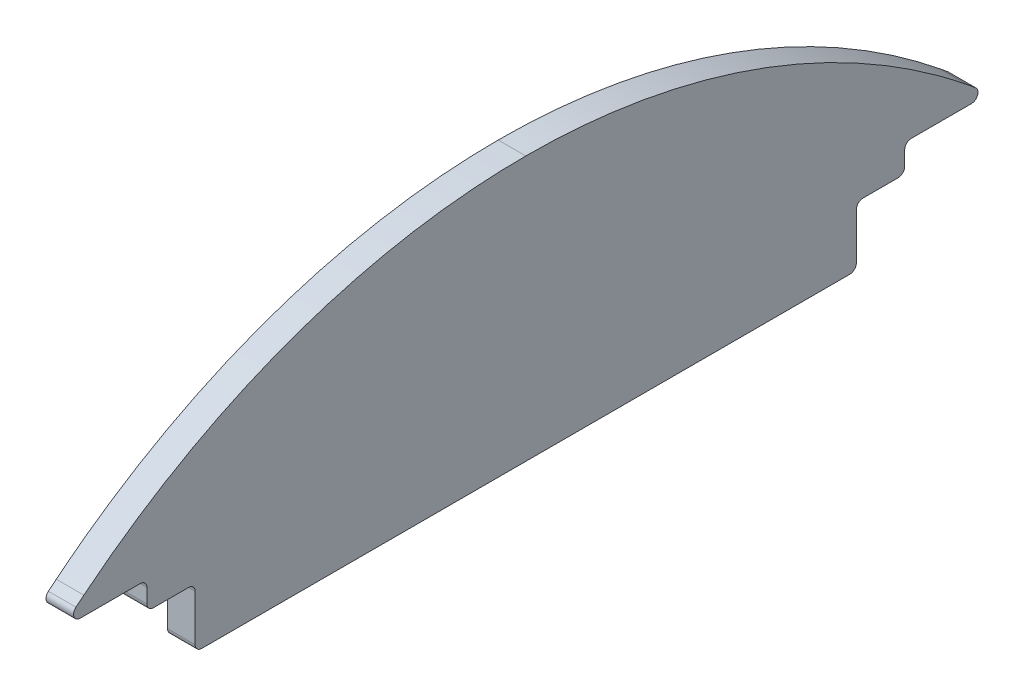
ISO-10303-21;
HEADER;
FILE_DESCRIPTION(('STEP AP214'),'2;1');
FILE_NAME('part.step','',(''),(''),'','','');
FILE_SCHEMA(('AUTOMOTIVE_DESIGN { 1 0 10303 214 1 1 1 1 }'));
ENDSEC;
DATA;
#1=APPLICATION_CONTEXT('core data for automotive mechanical design processes');
#2=APPLICATION_PROTOCOL_DEFINITION('international standard','automotive_design',2000,#1);
#3=PRODUCT_CONTEXT('',#1,'mechanical');
#4=PRODUCT('Part','Part','',(#3));
#5=PRODUCT_RELATED_PRODUCT_CATEGORY('part','',(#4));
#6=PRODUCT_DEFINITION_FORMATION('','',#4);
#7=PRODUCT_DEFINITION_CONTEXT('part definition',#1,'design');
#8=PRODUCT_DEFINITION('design','',#6,#7);
#9=PRODUCT_DEFINITION_SHAPE('','',#8);
#10=(LENGTH_UNIT() NAMED_UNIT(*) SI_UNIT(.MILLI.,.METRE.));
#11=(NAMED_UNIT(*) PLANE_ANGLE_UNIT() SI_UNIT($,.RADIAN.));
#12=(NAMED_UNIT(*) SI_UNIT($,.STERADIAN.) SOLID_ANGLE_UNIT());
#13=UNCERTAINTY_MEASURE_WITH_UNIT(LENGTH_MEASURE(1.E-05),#10,'distance_accuracy_value','');
#14=(GEOMETRIC_REPRESENTATION_CONTEXT(3) GLOBAL_UNCERTAINTY_ASSIGNED_CONTEXT((#13)) GLOBAL_UNIT_ASSIGNED_CONTEXT((#10,
#11,#12)) REPRESENTATION_CONTEXT('',''));
#15=CARTESIAN_POINT('',(0.,0.,0.));
#16=DIRECTION('',(0.,0.,1.));
#17=DIRECTION('',(1.,0.,0.));
#18=AXIS2_PLACEMENT_3D('',#15,#16,#17);
#19=CARTESIAN_POINT('',(-3.175,-11.8182922500257,0.));
#20=DIRECTION('',(0.,-1.,0.));
#21=DIRECTION('',(0.,0.,-1.));
#22=AXIS2_PLACEMENT_3D('',#19,#20,#21);
#23=PLANE('',#22);
#24=DIRECTION('',(0.,0.,-1.));
#25=VECTOR('',#24,1.);
#26=CARTESIAN_POINT('',(-3.175,-11.8182922500257,0.));
#27=LINE('',#26,#25);
#28=CARTESIAN_POINT('',(-3.175,-11.8182922500257,42.9012176847946));
#29=VERTEX_POINT('',#28);
#30=CARTESIAN_POINT('',(-3.175,-11.8182922500257,38.862));
#31=VERTEX_POINT('',#30);
#32=EDGE_CURVE('E268',#29,#31,#27,.T.);
#33=ORIENTED_EDGE('',*,*,#32,.T.);
#34=DIRECTION('',(1.,0.,0.));
#35=VECTOR('',#34,1.);
#36=CARTESIAN_POINT('',(0.,-11.8182922500257,38.862));
#37=LINE('',#36,#35);
#38=CARTESIAN_POINT('',(0.,-11.8182922500257,38.862));
#39=VERTEX_POINT('',#38);
#40=EDGE_CURVE('E419',#31,#39,#37,.T.);
#41=ORIENTED_EDGE('',*,*,#40,.T.);
#42=DIRECTION('',(0.,0.,-1.));
#43=VECTOR('',#42,1.);
#44=CARTESIAN_POINT('',(0.,-11.8182922500257,0.));
#45=LINE('',#44,#43);
#46=CARTESIAN_POINT('',(0.,-11.8182922500257,42.9012176847946));
#47=VERTEX_POINT('',#46);
#48=EDGE_CURVE('E525',#47,#39,#45,.T.);
#49=ORIENTED_EDGE('',*,*,#48,.F.);
#50=DIRECTION('',(1.,0.,0.));
#51=VECTOR('',#50,1.);
#52=CARTESIAN_POINT('',(-3.175,-11.8182922500257,42.9012176847946));
#53=LINE('',#52,#51);
#54=EDGE_CURVE('E417',#47,#29,#53,.F.);
#55=ORIENTED_EDGE('',*,*,#54,.T.);
#56=EDGE_LOOP('',(#33,#41,#49,#55));
#57=FACE_BOUND('',#56,.T.);
#58=ADVANCED_FACE('F38',(#57),#23,.T.);
#59=CARTESIAN_POINT('',(-3.175,11.8182914060908,-1.3436136690915E-06));
#60=CARTESIAN_POINT('',(-3.175,11.8077008078148,0.978048687892894));
#61=CARTESIAN_POINT('',(-3.175,11.786478389756,2.93795558926664));
#62=CARTESIAN_POINT('',(-3.175,11.614460814345,5.87961776837712));
#63=CARTESIAN_POINT('',(-3.175,11.3386627365121,8.82505008649082));
#64=CARTESIAN_POINT('',(-3.175,10.9480993080017,11.7706933833138));
#65=CARTESIAN_POINT('',(-3.175,10.4447203638757,14.7129490050857));
#66=CARTESIAN_POINT('',(-3.175,9.82713785355596,17.6481786841743));
#67=CARTESIAN_POINT('',(-3.175,9.09502004358851,20.5727043298639));
#68=CARTESIAN_POINT('',(-3.175,8.24791206700482,23.4828077640568));
#69=CARTESIAN_POINT('',(-3.175,7.28556085838308,26.3747308041278));
#70=CARTESIAN_POINT('',(-3.175,6.20783285537487,29.2446740978727));
#71=CARTESIAN_POINT('',(-3.175,5.014747428177,32.0888008013733));
#72=CARTESIAN_POINT('',(-3.175,3.70645854412326,34.9032222043669));
#73=CARTESIAN_POINT('',(-3.175,2.28332893837055,37.6840516060898));
#74=CARTESIAN_POINT('',(-3.175,0.745684639946392,40.4272012713032));
#75=CARTESIAN_POINT('',(-3.175,-0.905232129618184,43.1291482128365));
#76=CARTESIAN_POINT('',(-3.175,-2.67082562329719,45.7840472794463));
#77=CARTESIAN_POINT('',(-3.175,-4.54167859246508,48.3946206003429));
#78=CARTESIAN_POINT('',(-3.175,-5.87456843367821,50.07943235586));
#79=CARTESIAN_POINT('',(-3.175,-6.54342277936944,50.9248838174178));
#80=B_SPLINE_CURVE_WITH_KNOTS('',3,(#59,#60,#61,#62,#63,#64,#65,#66,#67,#68,#69,#70,#71,#72,#73,
#74,#75,#76,#77,#78,#79),.UNSPECIFIED.,.F.,.F.,(4,1,1,1,1,1,1,1,1,1,1,1,1,1,1,1,1,1,4),(0.,
0.0531569619047574,0.106520825251357,0.160104404736984,0.21392119364063,0.267985268264316,
0.322311180193934,0.376913837137565,0.431808373255161,0.487010010040896,0.542533908954217,
0.598395017114746,0.654607907476403,0.711186614976743,0.768144470217334,0.825493932271454,
0.883246422238132,0.941412159169929,1.),.UNSPECIFIED.);
#81=DIRECTION('',(1.,0.,0.));
#82=VECTOR('',#81,1.);
#83=SURFACE_OF_LINEAR_EXTRUSION('',#80,#82);
#84=CARTESIAN_POINT('',(0.,-6.54342277936944,50.9248838174178));
#85=CARTESIAN_POINT('',(0.,-5.87456843367821,50.07943235586));
#86=CARTESIAN_POINT('',(0.,-4.54167859246508,48.3946206003429));
#87=CARTESIAN_POINT('',(0.,-2.67082562329719,45.7840472794463));
#88=CARTESIAN_POINT('',(0.,-0.905232129618184,43.1291482128365));
#89=CARTESIAN_POINT('',(0.,0.745684639946392,40.4272012713032));
#90=CARTESIAN_POINT('',(0.,2.28332893837055,37.6840516060898));
#91=CARTESIAN_POINT('',(0.,3.70645854412326,34.9032222043669));
#92=CARTESIAN_POINT('',(0.,5.014747428177,32.0888008013733));
#93=CARTESIAN_POINT('',(0.,6.20783285537487,29.2446740978727));
#94=CARTESIAN_POINT('',(0.,7.28556085838308,26.3747308041278));
#95=CARTESIAN_POINT('',(0.,8.24791206700482,23.4828077640568));
#96=CARTESIAN_POINT('',(0.,9.09502004358851,20.5727043298639));
#97=CARTESIAN_POINT('',(0.,9.82713785355596,17.6481786841743));
#98=CARTESIAN_POINT('',(0.,10.4447203638757,14.7129490050857));
#99=CARTESIAN_POINT('',(0.,10.9480993080017,11.7706933833138));
#100=CARTESIAN_POINT('',(0.,11.3386627365121,8.82505008649082));
#101=CARTESIAN_POINT('',(0.,11.614460814345,5.87961776837712));
#102=CARTESIAN_POINT('',(0.,11.786478389756,2.93795558926664));
#103=CARTESIAN_POINT('',(0.,11.8077008078148,0.978048687892894));
#104=CARTESIAN_POINT('',(0.,11.8182914060908,-1.3436136690915E-06));
#105=B_SPLINE_CURVE_WITH_KNOTS('',3,(#84,#85,#86,#87,#88,#89,#90,#91,#92,#93,#94,#95,#96,#97,
#98,#99,#100,#101,#102,#103,#104),.UNSPECIFIED.,.F.,.F.,(4,1,1,1,1,1,1,1,1,1,1,1,1,1,1,1,1,1,4),
(0.,0.0585878408300714,0.116753577761868,0.174506067728546,0.231855529782666,0.288813385023257,
0.345392092523597,0.401604982885254,0.457466091045783,0.512989989959104,0.568191626744839,
0.623086162862435,0.677688819806066,0.732014731735684,0.78607880635937,0.839895595263016,
0.893479174748643,0.946843038095243,1.),.UNSPECIFIED.);
#106=CARTESIAN_POINT('',(0.,11.8182914060908,-1.3436136804792E-06));
#107=VERTEX_POINT('',#106);
#108=CARTESIAN_POINT('',(0.,-6.54342277936944,50.9248838174178));
#109=VERTEX_POINT('',#108);
#110=EDGE_CURVE('E482',#107,#109,#105,.F.);
#111=ORIENTED_EDGE('',*,*,#110,.F.);
#112=DIRECTION('',(1.,0.,0.));
#113=VECTOR('',#112,1.);
#114=CARTESIAN_POINT('',(-3.175,11.8182914060908,-1.3436136804792E-06));
#115=LINE('',#114,#113);
#116=CARTESIAN_POINT('',(-3.175,11.8182914060908,-1.3436136804792E-06));
#117=VERTEX_POINT('',#116);
#118=EDGE_CURVE('E221',#117,#107,#115,.T.);
#119=ORIENTED_EDGE('',*,*,#118,.F.);
#120=CARTESIAN_POINT('',(-3.175,11.8182914060908,-1.3436136690915E-06));
#121=CARTESIAN_POINT('',(-3.175,11.8077008078148,0.978048687892894));
#122=CARTESIAN_POINT('',(-3.175,11.786478389756,2.93795558926664));
#123=CARTESIAN_POINT('',(-3.175,11.614460814345,5.87961776837712));
#124=CARTESIAN_POINT('',(-3.175,11.3386627365121,8.82505008649082));
#125=CARTESIAN_POINT('',(-3.175,10.9480993080017,11.7706933833138));
#126=CARTESIAN_POINT('',(-3.175,10.4447203638757,14.7129490050857));
#127=CARTESIAN_POINT('',(-3.175,9.82713785355596,17.6481786841743));
#128=CARTESIAN_POINT('',(-3.175,9.09502004358851,20.5727043298639));
#129=CARTESIAN_POINT('',(-3.175,8.24791206700482,23.4828077640568));
#130=CARTESIAN_POINT('',(-3.175,7.28556085838308,26.3747308041278));
#131=CARTESIAN_POINT('',(-3.175,6.20783285537487,29.2446740978727));
#132=CARTESIAN_POINT('',(-3.175,5.014747428177,32.0888008013733));
#133=CARTESIAN_POINT('',(-3.175,3.70645854412326,34.9032222043669));
#134=CARTESIAN_POINT('',(-3.175,2.28332893837055,37.6840516060898));
#135=CARTESIAN_POINT('',(-3.175,0.745684639946392,40.4272012713032));
#136=CARTESIAN_POINT('',(-3.175,-0.905232129618184,43.1291482128365));
#137=CARTESIAN_POINT('',(-3.175,-2.67082562329719,45.7840472794463));
#138=CARTESIAN_POINT('',(-3.175,-4.54167859246508,48.3946206003429));
#139=CARTESIAN_POINT('',(-3.175,-5.87456843367821,50.07943235586));
#140=CARTESIAN_POINT('',(-3.175,-6.54342277936944,50.9248838174178));
#141=B_SPLINE_CURVE_WITH_KNOTS('',3,(#120,#121,#122,#123,#124,#125,#126,#127,#128,#129,#130,
#131,#132,#133,#134,#135,#136,#137,#138,#139,#140),.UNSPECIFIED.,.F.,.F.,(4,1,1,1,1,1,1,1,1,1,1,
1,1,1,1,1,1,1,4),(0.,0.0531569619047574,0.106520825251357,0.160104404736984,0.21392119364063,
0.267985268264316,0.322311180193934,0.376913837137565,0.431808373255161,0.487010010040896,
0.542533908954217,0.598395017114746,0.654607907476403,0.711186614976743,0.768144470217334,
0.825493932271454,0.883246422238132,0.941412159169929,1.),.UNSPECIFIED.);
#142=CARTESIAN_POINT('',(-3.175,-6.54342277936944,50.9248838174178));
#143=VERTEX_POINT('',#142);
#144=EDGE_CURVE('E213',#117,#143,#141,.T.);
#145=ORIENTED_EDGE('',*,*,#144,.T.);
#146=DIRECTION('',(1.,0.,0.));
#147=VECTOR('',#146,1.);
#148=CARTESIAN_POINT('',(-3.175,-6.54342277936944,50.9248838174178));
#149=LINE('',#148,#147);
#150=EDGE_CURVE('E192',#143,#109,#149,.T.);
#151=ORIENTED_EDGE('',*,*,#150,.T.);
#152=EDGE_LOOP('',(#111,#119,#145,#151));
#153=FACE_BOUND('',#152,.T.);
#154=ADVANCED_FACE('F220',(#153),#83,.T.);
#155=CARTESIAN_POINT('',(-3.175,-6.54342673515373,-50.9248893248076));
#156=CARTESIAN_POINT('',(-3.175,-5.90920633073445,-50.124144808466));
#157=CARTESIAN_POINT('',(-3.175,-4.64509800920185,-48.5281258228331));
#158=CARTESIAN_POINT('',(-3.175,-2.86419140149534,-46.0590871280758));
#159=CARTESIAN_POINT('',(-3.175,-1.17764504415261,-43.5498876670016));
#160=CARTESIAN_POINT('',(-3.175,0.406107926055533,-40.9978890230891));
#161=CARTESIAN_POINT('',(-3.175,1.88834277352226,-38.4081550633008));
#162=CARTESIAN_POINT('',(-3.175,3.26794007148094,-35.783665585972));
#163=CARTESIAN_POINT('',(-3.175,4.54459003603489,-33.1279121859897));
#164=CARTESIAN_POINT('',(-3.175,5.71793620145614,-30.444209343123));
#165=CARTESIAN_POINT('',(-3.175,6.78779660829162,-27.7358771668646));
#166=CARTESIAN_POINT('',(-3.175,7.75409969560054,-25.006192871303));
#167=CARTESIAN_POINT('',(-3.175,8.6168943287459,-22.2584037033444));
#168=CARTESIAN_POINT('',(-3.175,9.37634697084789,-19.495723603283));
#169=CARTESIAN_POINT('',(-3.175,10.0327178834013,-16.7213342277638));
#170=CARTESIAN_POINT('',(-3.175,10.586434134795,-13.9383848450785));
#171=CARTESIAN_POINT('',(-3.175,11.0377996797584,-11.149992553993));
#172=CARTESIAN_POINT('',(-3.175,11.3880527711752,-8.3592424235178));
#173=CARTESIAN_POINT('',(-3.175,11.6354276249399,-5.56918767928669));
#174=CARTESIAN_POINT('',(-3.175,11.7897476203975,-2.78284979237358));
#175=CARTESIAN_POINT('',(-3.175,11.8087884552902,-0.926482230833133));
#176=CARTESIAN_POINT('',(-3.175,11.8182914060908,-1.3436136804792E-06));
#177=B_SPLINE_CURVE_WITH_KNOTS('',3,(#155,#156,#157,#158,#159,#160,#161,#162,#163,#164,#165,
#166,#167,#168,#169,#170,#171,#172,#173,#174,#175,#176),.UNSPECIFIED.,.F.,.F.,(4,1,1,1,1,1,1,1,
1,1,1,1,1,1,1,1,1,1,1,4),(0.,0.0555148591435664,0.110650485104373,0.165414313175614,
0.219814889236602,0.273861748069295,0.327565288598301,0.380936647167056,0.433987569965251,
0.486730285719037,0.539177379744368,0.591341670441763,0.643236089277617,0.694873565251109,
0.74626691478746,0.7974287379278,0.848371321604614,0.89910655070147,0.949645827498104,1.),.UNSPECIFIED.);
#178=DIRECTION('',(1.,0.,0.));
#179=VECTOR('',#178,1.);
#180=SURFACE_OF_LINEAR_EXTRUSION('',#177,#179);
#181=CARTESIAN_POINT('',(0.,11.8182914060908,-1.3436136804792E-06));
#182=CARTESIAN_POINT('',(0.,11.8087884552902,-0.926482230833133));
#183=CARTESIAN_POINT('',(0.,11.7897476203975,-2.78284979237358));
#184=CARTESIAN_POINT('',(0.,11.6354276249399,-5.56918767928669));
#185=CARTESIAN_POINT('',(0.,11.3880527711752,-8.3592424235178));
#186=CARTESIAN_POINT('',(0.,11.0377996797584,-11.149992553993));
#187=CARTESIAN_POINT('',(0.,10.586434134795,-13.9383848450785));
#188=CARTESIAN_POINT('',(0.,10.0327178834013,-16.7213342277638));
#189=CARTESIAN_POINT('',(0.,9.37634697084789,-19.495723603283));
#190=CARTESIAN_POINT('',(0.,8.6168943287459,-22.2584037033444));
#191=CARTESIAN_POINT('',(0.,7.75409969560054,-25.006192871303));
#192=CARTESIAN_POINT('',(0.,6.78779660829162,-27.7358771668646));
#193=CARTESIAN_POINT('',(0.,5.71793620145614,-30.444209343123));
#194=CARTESIAN_POINT('',(0.,4.54459003603489,-33.1279121859897));
#195=CARTESIAN_POINT('',(0.,3.26794007148094,-35.783665585972));
#196=CARTESIAN_POINT('',(0.,1.88834277352226,-38.4081550633008));
#197=CARTESIAN_POINT('',(0.,0.406107926055533,-40.9978890230891));
#198=CARTESIAN_POINT('',(0.,-1.17764504415261,-43.5498876670016));
#199=CARTESIAN_POINT('',(0.,-2.86419140149534,-46.0590871280758));
#200=CARTESIAN_POINT('',(0.,-4.64509800920185,-48.5281258228331));
#201=CARTESIAN_POINT('',(0.,-5.90920633073445,-50.124144808466));
#202=CARTESIAN_POINT('',(0.,-6.54342673515373,-50.9248893248076));
#203=B_SPLINE_CURVE_WITH_KNOTS('',3,(#181,#182,#183,#184,#185,#186,#187,#188,#189,#190,#191,
#192,#193,#194,#195,#196,#197,#198,#199,#200,#201,#202),.UNSPECIFIED.,.F.,.F.,(4,1,1,1,1,1,1,1,
1,1,1,1,1,1,1,1,1,1,1,4),(0.,0.0503541725018962,0.100893449298529,0.151628678395386,
0.2025712620722,0.25373308521254,0.305126434748891,0.356763910722383,0.408658329558237,
0.460822620255632,0.513269714280963,0.566012430034749,0.619063352832944,0.672434711401699,
0.726138251930705,0.780185110763397,0.834585686824386,0.889349514895626,0.944485140856433,1.),.UNSPECIFIED.);
#204=CARTESIAN_POINT('',(0.,-6.54342673515373,-50.9248893248076));
#205=VERTEX_POINT('',#204);
#206=EDGE_CURVE('E222',#205,#107,#203,.F.);
#207=ORIENTED_EDGE('',*,*,#206,.F.);
#208=DIRECTION('',(1.,0.,0.));
#209=VECTOR('',#208,1.);
#210=CARTESIAN_POINT('',(-3.175,-6.54342673515373,-50.9248893248076));
#211=LINE('',#210,#209);
#212=CARTESIAN_POINT('',(-3.175,-6.54342673515373,-50.9248893248076));
#213=VERTEX_POINT('',#212);
#214=EDGE_CURVE('E205',#213,#205,#211,.T.);
#215=ORIENTED_EDGE('',*,*,#214,.F.);
#216=CARTESIAN_POINT('',(-3.175,-6.54342673515373,-50.9248893248076));
#217=CARTESIAN_POINT('',(-3.175,-5.90920633073445,-50.124144808466));
#218=CARTESIAN_POINT('',(-3.175,-4.64509800920185,-48.5281258228331));
#219=CARTESIAN_POINT('',(-3.175,-2.86419140149534,-46.0590871280758));
#220=CARTESIAN_POINT('',(-3.175,-1.17764504415261,-43.5498876670016));
#221=CARTESIAN_POINT('',(-3.175,0.406107926055533,-40.9978890230891));
#222=CARTESIAN_POINT('',(-3.175,1.88834277352226,-38.4081550633008));
#223=CARTESIAN_POINT('',(-3.175,3.26794007148094,-35.783665585972));
#224=CARTESIAN_POINT('',(-3.175,4.54459003603489,-33.1279121859897));
#225=CARTESIAN_POINT('',(-3.175,5.71793620145614,-30.444209343123));
#226=CARTESIAN_POINT('',(-3.175,6.78779660829162,-27.7358771668646));
#227=CARTESIAN_POINT('',(-3.175,7.75409969560054,-25.006192871303));
#228=CARTESIAN_POINT('',(-3.175,8.6168943287459,-22.2584037033444));
#229=CARTESIAN_POINT('',(-3.175,9.37634697084789,-19.495723603283));
#230=CARTESIAN_POINT('',(-3.175,10.0327178834013,-16.7213342277638));
#231=CARTESIAN_POINT('',(-3.175,10.586434134795,-13.9383848450785));
#232=CARTESIAN_POINT('',(-3.175,11.0377996797584,-11.149992553993));
#233=CARTESIAN_POINT('',(-3.175,11.3880527711752,-8.3592424235178));
#234=CARTESIAN_POINT('',(-3.175,11.6354276249399,-5.56918767928669));
#235=CARTESIAN_POINT('',(-3.175,11.7897476203975,-2.78284979237358));
#236=CARTESIAN_POINT('',(-3.175,11.8087884552902,-0.926482230833133));
#237=CARTESIAN_POINT('',(-3.175,11.8182914060908,-1.3436136804792E-06));
#238=B_SPLINE_CURVE_WITH_KNOTS('',3,(#216,#217,#218,#219,#220,#221,#222,#223,#224,#225,#226,
#227,#228,#229,#230,#231,#232,#233,#234,#235,#236,#237),.UNSPECIFIED.,.F.,.F.,(4,1,1,1,1,1,1,1,
1,1,1,1,1,1,1,1,1,1,1,4),(0.,0.0555148591435664,0.110650485104373,0.165414313175614,
0.219814889236602,0.273861748069295,0.327565288598301,0.380936647167056,0.433987569965251,
0.486730285719037,0.539177379744368,0.591341670441763,0.643236089277617,0.694873565251109,
0.74626691478746,0.7974287379278,0.848371321604614,0.89910655070147,0.949645827498104,1.),.UNSPECIFIED.);
#239=EDGE_CURVE('E206',#213,#117,#238,.T.);
#240=ORIENTED_EDGE('',*,*,#239,.T.);
#241=ORIENTED_EDGE('',*,*,#118,.T.);
#242=EDGE_LOOP('',(#207,#215,#240,#241));
#243=FACE_BOUND('',#242,.T.);
#244=ADVANCED_FACE('F241',(#243),#180,.T.);
#245=CARTESIAN_POINT('',(-3.175,-11.8182922500257,-56.8712182788418));
#246=CARTESIAN_POINT('',(-3.175,-11.2013644148107,-56.224282222961));
#247=CARTESIAN_POINT('',(-3.175,-9.97473353843866,-54.9379863292037));
#248=CARTESIAN_POINT('',(-3.175,-8.21567070856861,-52.9544098021391));
#249=CARTESIAN_POINT('',(-3.175,-7.09864687871228,-51.5987327762975));
#250=CARTESIAN_POINT('',(-3.175,-6.54342673515373,-50.9248893248076));
#251=B_SPLINE_CURVE_WITH_KNOTS('',3,(#245,#246,#247,#248,#249,#250),.UNSPECIFIED.,.F.,.F.,(4,1,
1,4),(0.,0.337268491237197,0.670587257316259,1.),.UNSPECIFIED.);
#252=DIRECTION('',(1.,0.,0.));
#253=VECTOR('',#252,1.);
#254=SURFACE_OF_LINEAR_EXTRUSION('',#251,#253);
#255=CARTESIAN_POINT('',(0.,-6.54342673515373,-50.9248893248076));
#256=CARTESIAN_POINT('',(0.,-6.79357843079945,-51.2284861664308));
#257=CARTESIAN_POINT('',(0.,-7.04373012644517,-51.532083008054));
#258=CARTESIAN_POINT('',(0.,-7.29498363161863,-51.8347512152745));
#259=B_SPLINE_CURVE_WITH_KNOTS('',3,(#255,#256,#257,#258),.UNSPECIFIED.,.F.,.F.,(4,4),
(0.851584714449478,1.),.UNSPECIFIED.);
#260=CARTESIAN_POINT('',(0.,-7.2954536152711,-51.8343610684496));
#261=VERTEX_POINT('',#260);
#262=EDGE_CURVE('E322',#261,#205,#259,.F.);
#263=ORIENTED_EDGE('',*,*,#262,.F.);
#264=DIRECTION('',(1.,0.,0.));
#265=VECTOR('',#264,1.);
#266=CARTESIAN_POINT('',(0.,-7.29498458273283,-51.8347523610178));
#267=LINE('',#266,#265);
#268=CARTESIAN_POINT('',(-3.175,-7.29545313898838,-51.8343604961247));
#269=VERTEX_POINT('',#268);
#270=EDGE_CURVE('E427',#261,#269,#267,.F.);
#271=ORIENTED_EDGE('',*,*,#270,.T.);
#272=CARTESIAN_POINT('',(-3.175,-7.29498363158758,-51.8347512152371));
#273=CARTESIAN_POINT('',(-3.175,-7.04373012642455,-51.532083008029));
#274=CARTESIAN_POINT('',(-3.175,-6.79357843078914,-51.2284861664183));
#275=CARTESIAN_POINT('',(-3.175,-6.54342673515373,-50.9248893248076));
#276=B_SPLINE_CURVE_WITH_KNOTS('',3,(#272,#273,#274,#275),.UNSPECIFIED.,.F.,.F.,(4,4),
(0.851584714455593,1.),.UNSPECIFIED.);
#277=EDGE_CURVE('E349',#269,#213,#276,.T.);
#278=ORIENTED_EDGE('',*,*,#277,.T.);
#279=ORIENTED_EDGE('',*,*,#214,.T.);
#280=EDGE_LOOP('',(#263,#271,#278,#279));
#281=FACE_BOUND('',#280,.T.);
#282=ADVANCED_FACE('F287',(#281),#254,.T.);
#283=CARTESIAN_POINT('',(-3.175,-8.64329225002528,0.));
#284=DIRECTION('',(0.,1.,0.));
#285=DIRECTION('',(0.,0.,1.));
#286=AXIS2_PLACEMENT_3D('',#283,#284,#285);
#287=PLANE('',#286);
#288=DIRECTION('',(0.,0.,1.));
#289=VECTOR('',#288,1.);
#290=CARTESIAN_POINT('',(-3.175,-8.64329225002528,0.));
#291=LINE('',#290,#289);
#292=CARTESIAN_POINT('',(-3.175,-8.64329225002583,-51.3480416468627));
#293=VERTEX_POINT('',#292);
#294=CARTESIAN_POINT('',(-3.175,-8.64329225002576,-44.4252182788419));
#295=VERTEX_POINT('',#294);
#296=EDGE_CURVE('E274',#293,#295,#291,.T.);
#297=ORIENTED_EDGE('',*,*,#296,.F.);
#298=DIRECTION('',(-1.,0.,0.));
#299=VECTOR('',#298,1.);
#300=CARTESIAN_POINT('',(0.,-8.64329225002583,-51.3480416468627));
#301=LINE('',#300,#299);
#302=CARTESIAN_POINT('',(0.,-8.64329225002583,-51.3480416468627));
#303=VERTEX_POINT('',#302);
#304=EDGE_CURVE('E424',#293,#303,#301,.F.);
#305=ORIENTED_EDGE('',*,*,#304,.T.);
#306=DIRECTION('',(0.,0.,1.));
#307=VECTOR('',#306,1.);
#308=CARTESIAN_POINT('',(0.,-8.64329225002528,0.));
#309=LINE('',#308,#307);
#310=CARTESIAN_POINT('',(0.,-8.64329225002576,-44.4252182788419));
#311=VERTEX_POINT('',#310);
#312=EDGE_CURVE('E518',#303,#311,#309,.T.);
#313=ORIENTED_EDGE('',*,*,#312,.T.);
#314=DIRECTION('',(1.,0.,0.));
#315=VECTOR('',#314,1.);
#316=CARTESIAN_POINT('',(-3.175,-8.64329225002576,-44.4252182788419));
#317=LINE('',#316,#315);
#318=EDGE_CURVE('E422',#311,#295,#317,.F.);
#319=ORIENTED_EDGE('',*,*,#318,.T.);
#320=EDGE_LOOP('',(#297,#305,#313,#319));
#321=FACE_BOUND('',#320,.T.);
#322=ADVANCED_FACE('F292',(#321),#287,.F.);
#323=CARTESIAN_POINT('',(-3.175,0.,-43.6632182788418));
#324=DIRECTION('',(0.,0.,1.));
#325=DIRECTION('',(1.,0.,0.));
#326=AXIS2_PLACEMENT_3D('',#323,#324,#325);
#327=PLANE('',#326);
#328=DIRECTION('',(0.,-1.,0.));
#329=VECTOR('',#328,1.);
#330=CARTESIAN_POINT('',(-3.175,0.,-43.6632182788418));
#331=LINE('',#330,#329);
#332=CARTESIAN_POINT('',(-3.175,-9.40529225002576,-43.6632182788418));
#333=VERTEX_POINT('',#332);
#334=CARTESIAN_POINT('',(-3.175,-11.0562922500257,-43.6632182788418));
#335=VERTEX_POINT('',#334);
#336=EDGE_CURVE('E271',#333,#335,#331,.T.);
#337=ORIENTED_EDGE('',*,*,#336,.F.);
#338=DIRECTION('',(1.,0.,0.));
#339=VECTOR('',#338,1.);
#340=CARTESIAN_POINT('',(0.,-9.40529225002576,-43.6632182788418));
#341=LINE('',#340,#339);
#342=CARTESIAN_POINT('',(0.,-9.40529225002576,-43.6632182788418));
#343=VERTEX_POINT('',#342);
#344=EDGE_CURVE('E433',#333,#343,#341,.T.);
#345=ORIENTED_EDGE('',*,*,#344,.T.);
#346=DIRECTION('',(0.,-1.,0.));
#347=VECTOR('',#346,1.);
#348=CARTESIAN_POINT('',(0.,0.,-43.6632182788418));
#349=LINE('',#348,#347);
#350=CARTESIAN_POINT('',(0.,-11.0562922500257,-43.6632182788418));
#351=VERTEX_POINT('',#350);
#352=EDGE_CURVE('E520',#343,#351,#349,.T.);
#353=ORIENTED_EDGE('',*,*,#352,.T.);
#354=DIRECTION('',(1.,0.,0.));
#355=VECTOR('',#354,1.);
#356=CARTESIAN_POINT('',(-3.175,-11.0562922500257,-43.6632182788418));
#357=LINE('',#356,#355);
#358=EDGE_CURVE('E429',#351,#335,#357,.F.);
#359=ORIENTED_EDGE('',*,*,#358,.T.);
#360=EDGE_LOOP('',(#337,#345,#353,#359));
#361=FACE_BOUND('',#360,.T.);
#362=ADVANCED_FACE('F550',(#361),#327,.F.);
#363=CARTESIAN_POINT('',(0.,-11.8182922500257,-38.862));
#364=VERTEX_POINT('',#363);
#365=CARTESIAN_POINT('',(0.,-11.8182922500257,-42.9012182788419));
#366=VERTEX_POINT('',#365);
#367=EDGE_CURVE('E475',#364,#366,#45,.T.);
#368=ORIENTED_EDGE('',*,*,#367,.F.);
#369=DIRECTION('',(1.,0.,0.));
#370=VECTOR('',#369,1.);
#371=CARTESIAN_POINT('',(-3.175,-11.8182922500257,-38.862));
#372=LINE('',#371,#370);
#373=CARTESIAN_POINT('',(-3.175,-11.8182922500257,-38.862));
#374=VERTEX_POINT('',#373);
#375=EDGE_CURVE('E410',#364,#374,#372,.F.);
#376=ORIENTED_EDGE('',*,*,#375,.T.);
#377=CARTESIAN_POINT('',(-3.175,-11.8182922500257,-42.9012182788419));
#378=VERTEX_POINT('',#377);
#379=EDGE_CURVE('E267',#374,#378,#27,.T.);
#380=ORIENTED_EDGE('',*,*,#379,.T.);
#381=DIRECTION('',(1.,0.,0.));
#382=VECTOR('',#381,1.);
#383=CARTESIAN_POINT('',(0.,-11.8182922500257,-42.9012182788419));
#384=LINE('',#383,#382);
#385=EDGE_CURVE('E407',#378,#366,#384,.T.);
#386=ORIENTED_EDGE('',*,*,#385,.T.);
#387=EDGE_LOOP('',(#368,#376,#380,#386));
#388=FACE_BOUND('',#387,.T.);
#389=ADVANCED_FACE('F559',(#388),#23,.T.);
#390=CARTESIAN_POINT('',(-3.175,0.,43.6632176847946));
#391=DIRECTION('',(0.,0.,1.));
#392=DIRECTION('',(1.,0.,0.));
#393=AXIS2_PLACEMENT_3D('',#390,#391,#392);
#394=PLANE('',#393);
#395=DIRECTION('',(0.,-1.,0.));
#396=VECTOR('',#395,1.);
#397=CARTESIAN_POINT('',(-3.175,0.,43.6632176847946));
#398=LINE('',#397,#396);
#399=CARTESIAN_POINT('',(-3.175,-9.40529225002586,43.6632176847946));
#400=VERTEX_POINT('',#399);
#401=CARTESIAN_POINT('',(-3.175,-11.0562922500257,43.6632176847946));
#402=VERTEX_POINT('',#401);
#403=EDGE_CURVE('E261',#400,#402,#398,.T.);
#404=ORIENTED_EDGE('',*,*,#403,.T.);
#405=DIRECTION('',(1.,0.,0.));
#406=VECTOR('',#405,1.);
#407=CARTESIAN_POINT('',(-3.175,-11.0562922500257,43.6632176847946));
#408=LINE('',#407,#406);
#409=CARTESIAN_POINT('',(0.,-11.0562922500257,43.6632176847946));
#410=VERTEX_POINT('',#409);
#411=EDGE_CURVE('E438',#402,#410,#408,.T.);
#412=ORIENTED_EDGE('',*,*,#411,.T.);
#413=DIRECTION('',(0.,-1.,0.));
#414=VECTOR('',#413,1.);
#415=CARTESIAN_POINT('',(0.,0.,43.6632176847946));
#416=LINE('',#415,#414);
#417=CARTESIAN_POINT('',(0.,-9.40529225002586,43.6632176847946));
#418=VERTEX_POINT('',#417);
#419=EDGE_CURVE('E466',#418,#410,#416,.T.);
#420=ORIENTED_EDGE('',*,*,#419,.F.);
#421=DIRECTION('',(1.,0.,0.));
#422=VECTOR('',#421,1.);
#423=CARTESIAN_POINT('',(-3.175,-9.40529225002586,43.6632176847946));
#424=LINE('',#423,#422);
#425=EDGE_CURVE('E436',#418,#400,#424,.F.);
#426=ORIENTED_EDGE('',*,*,#425,.T.);
#427=EDGE_LOOP('',(#404,#412,#420,#426));
#428=FACE_BOUND('',#427,.T.);
#429=ADVANCED_FACE('F473',(#428),#394,.T.);
#430=CARTESIAN_POINT('',(-3.175,-8.64329225002585,0.));
#431=DIRECTION('',(0.,-1.,0.));
#432=DIRECTION('',(0.,0.,-1.));
#433=AXIS2_PLACEMENT_3D('',#430,#431,#432);
#434=PLANE('',#433);
#435=DIRECTION('',(0.,0.,-1.));
#436=VECTOR('',#435,1.);
#437=CARTESIAN_POINT('',(-3.175,-8.64329225002585,0.));
#438=LINE('',#437,#436);
#439=CARTESIAN_POINT('',(-3.175,-8.64329225002585,51.3480410312409));
#440=VERTEX_POINT('',#439);
#441=CARTESIAN_POINT('',(-3.175,-8.64329225002585,44.4252176847946));
#442=VERTEX_POINT('',#441);
#443=EDGE_CURVE('E216',#440,#442,#438,.T.);
#444=ORIENTED_EDGE('',*,*,#443,.T.);
#445=DIRECTION('',(1.,0.,0.));
#446=VECTOR('',#445,1.);
#447=CARTESIAN_POINT('',(0.,-8.64329225002585,44.4252176847946));
#448=LINE('',#447,#446);
#449=CARTESIAN_POINT('',(0.,-8.64329225002585,44.4252176847946));
#450=VERTEX_POINT('',#449);
#451=EDGE_CURVE('E443',#442,#450,#448,.T.);
#452=ORIENTED_EDGE('',*,*,#451,.T.);
#453=DIRECTION('',(0.,0.,-1.));
#454=VECTOR('',#453,1.);
#455=CARTESIAN_POINT('',(0.,-8.64329225002585,0.));
#456=LINE('',#455,#454);
#457=CARTESIAN_POINT('',(0.,-8.64329225002585,51.3480410312409));
#458=VERTEX_POINT('',#457);
#459=EDGE_CURVE('E468',#458,#450,#456,.T.);
#460=ORIENTED_EDGE('',*,*,#459,.F.);
#461=DIRECTION('',(1.,0.,0.));
#462=VECTOR('',#461,1.);
#463=CARTESIAN_POINT('',(-3.175,-8.64329225002585,51.3480410312409));
#464=LINE('',#463,#462);
#465=EDGE_CURVE('E441',#458,#440,#464,.F.);
#466=ORIENTED_EDGE('',*,*,#465,.T.);
#467=EDGE_LOOP('',(#444,#452,#460,#466));
#468=FACE_BOUND('',#467,.T.);
#469=ADVANCED_FACE('F478',(#468),#434,.T.);
#470=CARTESIAN_POINT('',(-3.175,-6.54342277936944,50.9248838174178));
#471=CARTESIAN_POINT('',(-3.175,-7.09864331252852,51.5987278344753));
#472=CARTESIAN_POINT('',(-3.175,-8.21566793155283,52.954406004648));
#473=CARTESIAN_POINT('',(-3.175,-9.9747320818545,54.9379841731504));
#474=CARTESIAN_POINT('',(-3.175,-11.2013639254373,56.2242811044094));
#475=CARTESIAN_POINT('',(-3.175,-11.8182922500257,56.8712176851582));
#476=B_SPLINE_CURVE_WITH_KNOTS('',3,(#470,#471,#472,#473,#474,#475),.UNSPECIFIED.,.F.,.F.,(4,1,
1,4),(0.,0.329412739523442,0.662731505577217,1.),.UNSPECIFIED.);
#477=DIRECTION('',(1.,0.,0.));
#478=VECTOR('',#477,1.);
#479=SURFACE_OF_LINEAR_EXTRUSION('',#476,#478);
#480=CARTESIAN_POINT('',(-3.175,-6.54342277936944,50.9248838174178));
#481=CARTESIAN_POINT('',(-3.175,-6.79357578290924,51.2284822881465));
#482=CARTESIAN_POINT('',(-3.175,-7.04372878644905,51.5320807588752));
#483=CARTESIAN_POINT('',(-3.175,-7.29498361628368,51.8347505811796));
#484=B_SPLINE_CURVE_WITH_KNOTS('',3,(#480,#481,#482,#483),.UNSPECIFIED.,.F.,.F.,(4,4),(0.,
0.148415955957545),.UNSPECIFIED.);
#485=CARTESIAN_POINT('',(-3.175,-7.29545312805557,51.8343598584544));
#486=VERTEX_POINT('',#485);
#487=EDGE_CURVE('E195',#143,#486,#484,.T.);
#488=ORIENTED_EDGE('',*,*,#487,.T.);
#489=DIRECTION('',(1.,0.,0.));
#490=VECTOR('',#489,1.);
#491=CARTESIAN_POINT('',(-3.175,-7.29498456743793,51.8347517269713));
#492=LINE('',#491,#490);
#493=CARTESIAN_POINT('',(0.,-7.29545312840139,51.8343598581606));
#494=VERTEX_POINT('',#493);
#495=EDGE_CURVE('E446',#486,#494,#492,.T.);
#496=ORIENTED_EDGE('',*,*,#495,.T.);
#497=CARTESIAN_POINT('',(0.,-7.29498314072072,51.8347500083009));
#498=CARTESIAN_POINT('',(0.,-7.04372847079739,51.5320803757842));
#499=CARTESIAN_POINT('',(0.,-6.79357562508341,51.228482096601));
#500=CARTESIAN_POINT('',(0.,-6.54342277936944,50.9248838174178));
#501=B_SPLINE_CURVE_WITH_KNOTS('',3,(#497,#498,#499,#500),.UNSPECIFIED.,.F.,.F.,(4,4),(0.,
0.148415862319368),.UNSPECIFIED.);
#502=EDGE_CURVE('E199',#109,#494,#501,.F.);
#503=ORIENTED_EDGE('',*,*,#502,.F.);
#504=ORIENTED_EDGE('',*,*,#150,.F.);
#505=EDGE_LOOP('',(#488,#496,#503,#504));
#506=FACE_BOUND('',#505,.T.);
#507=ADVANCED_FACE('F193',(#506),#479,.T.);
#508=CARTESIAN_POINT('',(-3.175,0.,0.));
#509=DIRECTION('',(1.,0.,0.));
#510=DIRECTION('',(0.,0.,-1.));
#511=AXIS2_PLACEMENT_3D('',#508,#509,#510);
#512=PLANE('',#511);
#513=DIRECTION('',(0.,1.,0.));
#514=VECTOR('',#513,1.);
#515=CARTESIAN_POINT('',(-3.175,0.,-38.1));
#516=LINE('',#515,#514);
#517=CARTESIAN_POINT('',(-3.175,-17.8997085860257,-38.1));
#518=VERTEX_POINT('',#517);
#519=CARTESIAN_POINT('',(-3.175,-12.5802922500257,-38.1));
#520=VERTEX_POINT('',#519);
#521=EDGE_CURVE('E487',#518,#520,#516,.T.);
#522=ORIENTED_EDGE('',*,*,#521,.F.);
#523=CARTESIAN_POINT('',(-3.175,-17.8997085860257,-37.338));
#524=DIRECTION('',(1.,0.,0.));
#525=DIRECTION('',(0.,0.,-1.));
#526=AXIS2_PLACEMENT_3D('',#523,#524,#525);
#527=CIRCLE('',#526,0.762);
#528=CARTESIAN_POINT('',(-3.175,-18.6617085860257,-37.338));
#529=VERTEX_POINT('',#528);
#530=EDGE_CURVE('E405',#518,#529,#527,.F.);
#531=ORIENTED_EDGE('',*,*,#530,.T.);
#532=DIRECTION('',(0.,0.,-1.));
#533=VECTOR('',#532,1.);
#534=CARTESIAN_POINT('',(-3.175,-18.6617085860257,0.));
#535=LINE('',#534,#533);
#536=CARTESIAN_POINT('',(-3.175,-18.6617085860257,37.338));
#537=VERTEX_POINT('',#536);
#538=EDGE_CURVE('E493',#537,#529,#535,.T.);
#539=ORIENTED_EDGE('',*,*,#538,.F.);
#540=CARTESIAN_POINT('',(-3.175,-17.8997085860257,37.338));
#541=DIRECTION('',(1.,0.,0.));
#542=DIRECTION('',(0.,0.,-1.));
#543=AXIS2_PLACEMENT_3D('',#540,#541,#542);
#544=CIRCLE('',#543,0.762);
#545=CARTESIAN_POINT('',(-3.175,-17.8997085860257,38.1));
#546=VERTEX_POINT('',#545);
#547=EDGE_CURVE('E401',#537,#546,#544,.F.);
#548=ORIENTED_EDGE('',*,*,#547,.T.);
#549=DIRECTION('',(0.,-1.,0.));
#550=VECTOR('',#549,1.);
#551=CARTESIAN_POINT('',(-3.175,0.,38.1));
#552=LINE('',#551,#550);
#553=CARTESIAN_POINT('',(-3.175,-12.5802922500257,38.1));
#554=VERTEX_POINT('',#553);
#555=EDGE_CURVE('E485',#554,#546,#552,.T.);
#556=ORIENTED_EDGE('',*,*,#555,.F.);
#557=CARTESIAN_POINT('',(-3.175,-12.5802922500257,38.862));
#558=DIRECTION('',(1.,0.,0.));
#559=DIRECTION('',(0.,0.,-1.));
#560=AXIS2_PLACEMENT_3D('',#557,#558,#559);
#561=CIRCLE('',#560,0.762);
#562=EDGE_CURVE('E456',#554,#31,#561,.T.);
#563=ORIENTED_EDGE('',*,*,#562,.T.);
#564=ORIENTED_EDGE('',*,*,#32,.F.);
#565=CARTESIAN_POINT('',(-3.175,-11.0562922500257,42.9012176847946));
#566=DIRECTION('',(1.,0.,0.));
#567=DIRECTION('',(0.,0.,-1.));
#568=AXIS2_PLACEMENT_3D('',#565,#566,#567);
#569=CIRCLE('',#568,0.762);
#570=EDGE_CURVE('E393',#29,#402,#569,.F.);
#571=ORIENTED_EDGE('',*,*,#570,.T.);
#572=ORIENTED_EDGE('',*,*,#403,.F.);
#573=CARTESIAN_POINT('',(-3.175,-9.40529225002586,44.4252176847946));
#574=DIRECTION('',(1.,0.,0.));
#575=DIRECTION('',(0.,0.,-1.));
#576=AXIS2_PLACEMENT_3D('',#573,#574,#575);
#577=CIRCLE('',#576,0.762);
#578=EDGE_CURVE('E11',#400,#442,#577,.T.);
#579=ORIENTED_EDGE('',*,*,#578,.T.);
#580=ORIENTED_EDGE('',*,*,#443,.F.);
#581=CARTESIAN_POINT('',(-3.175,-7.88129225002585,51.3480410312409));
#582=DIRECTION('',(1.,0.,0.));
#583=DIRECTION('',(0.,0.,-1.));
#584=AXIS2_PLACEMENT_3D('',#581,#582,#583);
#585=CIRCLE('',#584,0.762);
#586=EDGE_CURVE('E53',#440,#486,#585,.F.);
#587=ORIENTED_EDGE('',*,*,#586,.T.);
#588=ORIENTED_EDGE('',*,*,#487,.F.);
#589=ORIENTED_EDGE('',*,*,#144,.F.);
#590=ORIENTED_EDGE('',*,*,#239,.F.);
#591=ORIENTED_EDGE('',*,*,#277,.F.);
#592=CARTESIAN_POINT('',(-3.175,-7.88129225002583,-51.3480416468627));
#593=DIRECTION('',(1.,0.,0.));
#594=DIRECTION('',(0.,0.,-1.));
#595=AXIS2_PLACEMENT_3D('',#592,#593,#594);
#596=CIRCLE('',#595,0.762);
#597=EDGE_CURVE('E399',#269,#293,#596,.F.);
#598=ORIENTED_EDGE('',*,*,#597,.T.);
#599=ORIENTED_EDGE('',*,*,#296,.T.);
#600=CARTESIAN_POINT('',(-3.175,-9.40529225002576,-44.4252182788418));
#601=DIRECTION('',(1.,0.,0.));
#602=DIRECTION('',(0.,0.,-1.));
#603=AXIS2_PLACEMENT_3D('',#600,#601,#602);
#604=CIRCLE('',#603,0.762);
#605=EDGE_CURVE('E460',#295,#333,#604,.T.);
#606=ORIENTED_EDGE('',*,*,#605,.T.);
#607=ORIENTED_EDGE('',*,*,#336,.T.);
#608=CARTESIAN_POINT('',(-3.175,-11.0562922500257,-42.9012182788419));
#609=DIRECTION('',(1.,0.,0.));
#610=DIRECTION('',(0.,0.,-1.));
#611=AXIS2_PLACEMENT_3D('',#608,#609,#610);
#612=CIRCLE('',#611,0.762);
#613=EDGE_CURVE('E397',#335,#378,#612,.F.);
#614=ORIENTED_EDGE('',*,*,#613,.T.);
#615=ORIENTED_EDGE('',*,*,#379,.F.);
#616=CARTESIAN_POINT('',(-3.175,-12.5802922500257,-38.862));
#617=DIRECTION('',(1.,0.,0.));
#618=DIRECTION('',(0.,0.,-1.));
#619=AXIS2_PLACEMENT_3D('',#616,#617,#618);
#620=CIRCLE('',#619,0.762);
#621=EDGE_CURVE('E452',#374,#520,#620,.T.);
#622=ORIENTED_EDGE('',*,*,#621,.T.);
#623=EDGE_LOOP('',(#522,#531,#539,#548,#556,#563,#564,#571,#572,#579,#580,#587,#588,#589,#590,
#591,#598,#599,#606,#607,#614,#615,#622));
#624=FACE_BOUND('',#623,.T.);
#625=ADVANCED_FACE('F211',(#624),#512,.F.);
#626=CARTESIAN_POINT('',(0.,0.,0.));
#627=DIRECTION('',(1.,0.,0.));
#628=DIRECTION('',(0.,0.,-1.));
#629=AXIS2_PLACEMENT_3D('',#626,#627,#628);
#630=PLANE('',#629);
#631=DIRECTION('',(0.,0.,-1.));
#632=VECTOR('',#631,1.);
#633=CARTESIAN_POINT('',(0.,-18.6617085860257,0.));
#634=LINE('',#633,#632);
#635=CARTESIAN_POINT('',(0.,-18.6617085860257,37.338));
#636=VERTEX_POINT('',#635);
#637=CARTESIAN_POINT('',(0.,-18.6617085860257,-37.338));
#638=VERTEX_POINT('',#637);
#639=EDGE_CURVE('E497',#636,#638,#634,.T.);
#640=ORIENTED_EDGE('',*,*,#639,.T.);
#641=CARTESIAN_POINT('',(0.,-17.8997085860257,-37.338));
#642=DIRECTION('',(1.,0.,0.));
#643=DIRECTION('',(0.,0.,-1.));
#644=AXIS2_PLACEMENT_3D('',#641,#642,#643);
#645=CIRCLE('',#644,0.762);
#646=CARTESIAN_POINT('',(0.,-17.8997085860257,-38.1));
#647=VERTEX_POINT('',#646);
#648=EDGE_CURVE('E340',#638,#647,#645,.T.);
#649=ORIENTED_EDGE('',*,*,#648,.T.);
#650=DIRECTION('',(0.,1.,0.));
#651=VECTOR('',#650,1.);
#652=CARTESIAN_POINT('',(0.,0.,-38.1));
#653=LINE('',#652,#651);
#654=CARTESIAN_POINT('',(0.,-12.5802922500257,-38.1));
#655=VERTEX_POINT('',#654);
#656=EDGE_CURVE('E498',#647,#655,#653,.T.);
#657=ORIENTED_EDGE('',*,*,#656,.T.);
#658=CARTESIAN_POINT('',(0.,-12.5802922500257,-38.862));
#659=DIRECTION('',(1.,0.,0.));
#660=DIRECTION('',(0.,0.,-1.));
#661=AXIS2_PLACEMENT_3D('',#658,#659,#660);
#662=CIRCLE('',#661,0.762);
#663=EDGE_CURVE('E448',#655,#364,#662,.F.);
#664=ORIENTED_EDGE('',*,*,#663,.T.);
#665=ORIENTED_EDGE('',*,*,#367,.T.);
#666=CARTESIAN_POINT('',(0.,-11.0562922500257,-42.9012182788419));
#667=DIRECTION('',(1.,0.,0.));
#668=DIRECTION('',(0.,0.,-1.));
#669=AXIS2_PLACEMENT_3D('',#666,#667,#668);
#670=CIRCLE('',#669,0.762);
#671=EDGE_CURVE('E332',#366,#351,#670,.T.);
#672=ORIENTED_EDGE('',*,*,#671,.T.);
#673=ORIENTED_EDGE('',*,*,#352,.F.);
#674=CARTESIAN_POINT('',(0.,-9.40529225002576,-44.4252182788418));
#675=DIRECTION('',(1.,0.,0.));
#676=DIRECTION('',(0.,0.,-1.));
#677=AXIS2_PLACEMENT_3D('',#674,#675,#676);
#678=CIRCLE('',#677,0.762);
#679=EDGE_CURVE('E458',#343,#311,#678,.F.);
#680=ORIENTED_EDGE('',*,*,#679,.T.);
#681=ORIENTED_EDGE('',*,*,#312,.F.);
#682=CARTESIAN_POINT('',(0.,-7.88129225002583,-51.3480416468627));
#683=DIRECTION('',(1.,0.,0.));
#684=DIRECTION('',(0.,0.,-1.));
#685=AXIS2_PLACEMENT_3D('',#682,#683,#684);
#686=CIRCLE('',#685,0.762);
#687=EDGE_CURVE('E334',#303,#261,#686,.T.);
#688=ORIENTED_EDGE('',*,*,#687,.T.);
#689=ORIENTED_EDGE('',*,*,#262,.T.);
#690=ORIENTED_EDGE('',*,*,#206,.T.);
#691=ORIENTED_EDGE('',*,*,#110,.T.);
#692=ORIENTED_EDGE('',*,*,#502,.T.);
#693=CARTESIAN_POINT('',(0.,-7.88129225002585,51.3480410312409));
#694=DIRECTION('',(1.,0.,0.));
#695=DIRECTION('',(0.,0.,-1.));
#696=AXIS2_PLACEMENT_3D('',#693,#694,#695);
#697=CIRCLE('',#696,0.762);
#698=EDGE_CURVE('E325',#494,#458,#697,.T.);
#699=ORIENTED_EDGE('',*,*,#698,.T.);
#700=ORIENTED_EDGE('',*,*,#459,.T.);
#701=CARTESIAN_POINT('',(0.,-9.40529225002586,44.4252176847946));
#702=DIRECTION('',(1.,0.,0.));
#703=DIRECTION('',(0.,0.,-1.));
#704=AXIS2_PLACEMENT_3D('',#701,#702,#703);
#705=CIRCLE('',#704,0.762);
#706=EDGE_CURVE('E46',#450,#418,#705,.F.);
#707=ORIENTED_EDGE('',*,*,#706,.T.);
#708=ORIENTED_EDGE('',*,*,#419,.T.);
#709=CARTESIAN_POINT('',(0.,-11.0562922500257,42.9012176847946));
#710=DIRECTION('',(1.,0.,0.));
#711=DIRECTION('',(0.,0.,-1.));
#712=AXIS2_PLACEMENT_3D('',#709,#710,#711);
#713=CIRCLE('',#712,0.762);
#714=EDGE_CURVE('E327',#410,#47,#713,.T.);
#715=ORIENTED_EDGE('',*,*,#714,.T.);
#716=ORIENTED_EDGE('',*,*,#48,.T.);
#717=CARTESIAN_POINT('',(0.,-12.5802922500257,38.862));
#718=DIRECTION('',(1.,0.,0.));
#719=DIRECTION('',(0.,0.,-1.));
#720=AXIS2_PLACEMENT_3D('',#717,#718,#719);
#721=CIRCLE('',#720,0.762);
#722=CARTESIAN_POINT('',(0.,-12.5802922500257,38.1));
#723=VERTEX_POINT('',#722);
#724=EDGE_CURVE('E454',#39,#723,#721,.F.);
#725=ORIENTED_EDGE('',*,*,#724,.T.);
#726=DIRECTION('',(0.,-1.,0.));
#727=VECTOR('',#726,1.);
#728=CARTESIAN_POINT('',(0.,0.,38.1));
#729=LINE('',#728,#727);
#730=CARTESIAN_POINT('',(0.,-17.8997085860257,38.1));
#731=VERTEX_POINT('',#730);
#732=EDGE_CURVE('E252',#723,#731,#729,.T.);
#733=ORIENTED_EDGE('',*,*,#732,.T.);
#734=CARTESIAN_POINT('',(0.,-17.8997085860257,37.338));
#735=DIRECTION('',(1.,0.,0.));
#736=DIRECTION('',(0.,0.,-1.));
#737=AXIS2_PLACEMENT_3D('',#734,#735,#736);
#738=CIRCLE('',#737,0.762);
#739=EDGE_CURVE('E336',#731,#636,#738,.T.);
#740=ORIENTED_EDGE('',*,*,#739,.T.);
#741=EDGE_LOOP('',(#640,#649,#657,#664,#665,#672,#673,#680,#681,#688,#689,#690,#691,#692,#699,
#700,#707,#708,#715,#716,#725,#733,#740));
#742=FACE_BOUND('',#741,.T.);
#743=ADVANCED_FACE('F366',(#742),#630,.T.);
#744=CARTESIAN_POINT('',(-3.175,-18.6617085860257,0.));
#745=DIRECTION('',(0.,-1.,0.));
#746=DIRECTION('',(0.,0.,-1.));
#747=AXIS2_PLACEMENT_3D('',#744,#745,#746);
#748=PLANE('',#747);
#749=ORIENTED_EDGE('',*,*,#538,.T.);
#750=DIRECTION('',(1.,0.,0.));
#751=VECTOR('',#750,1.);
#752=CARTESIAN_POINT('',(-3.175,-18.6617085860257,-37.338));
#753=LINE('',#752,#751);
#754=EDGE_CURVE('E328',#529,#638,#753,.T.);
#755=ORIENTED_EDGE('',*,*,#754,.T.);
#756=ORIENTED_EDGE('',*,*,#639,.F.);
#757=DIRECTION('',(1.,0.,0.));
#758=VECTOR('',#757,1.);
#759=CARTESIAN_POINT('',(-3.175,-18.6617085860257,37.338));
#760=LINE('',#759,#758);
#761=EDGE_CURVE('E510',#636,#537,#760,.F.);
#762=ORIENTED_EDGE('',*,*,#761,.T.);
#763=EDGE_LOOP('',(#749,#755,#756,#762));
#764=FACE_BOUND('',#763,.T.);
#765=ADVANCED_FACE('F367',(#764),#748,.T.);
#766=CARTESIAN_POINT('',(-3.175,0.,38.1));
#767=DIRECTION('',(0.,0.,1.));
#768=DIRECTION('',(1.,0.,0.));
#769=AXIS2_PLACEMENT_3D('',#766,#767,#768);
#770=PLANE('',#769);
#771=ORIENTED_EDGE('',*,*,#555,.T.);
#772=DIRECTION('',(1.,0.,0.));
#773=VECTOR('',#772,1.);
#774=CARTESIAN_POINT('',(-3.175,-17.8997085860257,38.1));
#775=LINE('',#774,#773);
#776=EDGE_CURVE('E414',#546,#731,#775,.T.);
#777=ORIENTED_EDGE('',*,*,#776,.T.);
#778=ORIENTED_EDGE('',*,*,#732,.F.);
#779=DIRECTION('',(1.,0.,0.));
#780=VECTOR('',#779,1.);
#781=CARTESIAN_POINT('',(-3.175,-12.5802922500257,38.1));
#782=LINE('',#781,#780);
#783=EDGE_CURVE('E412',#723,#554,#782,.F.);
#784=ORIENTED_EDGE('',*,*,#783,.T.);
#785=EDGE_LOOP('',(#771,#777,#778,#784));
#786=FACE_BOUND('',#785,.T.);
#787=ADVANCED_FACE('F569',(#786),#770,.T.);
#788=CARTESIAN_POINT('',(-3.175,0.,-38.1));
#789=DIRECTION('',(0.,0.,-1.));
#790=DIRECTION('',(-1.,0.,0.));
#791=AXIS2_PLACEMENT_3D('',#788,#789,#790);
#792=PLANE('',#791);
#793=ORIENTED_EDGE('',*,*,#656,.F.);
#794=DIRECTION('',(1.,0.,0.));
#795=VECTOR('',#794,1.);
#796=CARTESIAN_POINT('',(-3.175,-17.8997085860257,-38.1));
#797=LINE('',#796,#795);
#798=EDGE_CURVE('E345',#647,#518,#797,.F.);
#799=ORIENTED_EDGE('',*,*,#798,.T.);
#800=ORIENTED_EDGE('',*,*,#521,.T.);
#801=DIRECTION('',(1.,0.,0.));
#802=VECTOR('',#801,1.);
#803=CARTESIAN_POINT('',(0.,-12.5802922500257,-38.1));
#804=LINE('',#803,#802);
#805=EDGE_CURVE('E342',#520,#655,#804,.T.);
#806=ORIENTED_EDGE('',*,*,#805,.T.);
#807=EDGE_LOOP('',(#793,#799,#800,#806));
#808=FACE_BOUND('',#807,.T.);
#809=ADVANCED_FACE('F567',(#808),#792,.T.);
#810=CARTESIAN_POINT('',(-3.175,-17.8997085860257,-37.338));
#811=DIRECTION('',(1.,0.,0.));
#812=DIRECTION('',(0.,0.,-1.));
#813=AXIS2_PLACEMENT_3D('',#810,#811,#812);
#814=CYLINDRICAL_SURFACE('',#813,0.762);
#815=ORIENTED_EDGE('',*,*,#530,.F.);
#816=ORIENTED_EDGE('',*,*,#798,.F.);
#817=ORIENTED_EDGE('',*,*,#648,.F.);
#818=ORIENTED_EDGE('',*,*,#754,.F.);
#819=EDGE_LOOP('',(#815,#816,#817,#818));
#820=FACE_BOUND('',#819,.T.);
#821=ADVANCED_FACE('F245',(#820),#814,.T.);
#822=CARTESIAN_POINT('',(-3.175,-12.5802922500257,-38.862));
#823=DIRECTION('',(-1.,0.,0.));
#824=DIRECTION('',(0.,0.,1.));
#825=AXIS2_PLACEMENT_3D('',#822,#823,#824);
#826=CYLINDRICAL_SURFACE('',#825,0.762);
#827=ORIENTED_EDGE('',*,*,#621,.F.);
#828=ORIENTED_EDGE('',*,*,#375,.F.);
#829=ORIENTED_EDGE('',*,*,#663,.F.);
#830=ORIENTED_EDGE('',*,*,#805,.F.);
#831=EDGE_LOOP('',(#827,#828,#829,#830));
#832=FACE_BOUND('',#831,.T.);
#833=ADVANCED_FACE('F565',(#832),#826,.F.);
#834=CARTESIAN_POINT('',(-3.175,-17.8997085860257,37.338));
#835=DIRECTION('',(1.,0.,0.));
#836=DIRECTION('',(0.,0.,-1.));
#837=AXIS2_PLACEMENT_3D('',#834,#835,#836);
#838=CYLINDRICAL_SURFACE('',#837,0.762);
#839=ORIENTED_EDGE('',*,*,#547,.F.);
#840=ORIENTED_EDGE('',*,*,#761,.F.);
#841=ORIENTED_EDGE('',*,*,#739,.F.);
#842=ORIENTED_EDGE('',*,*,#776,.F.);
#843=EDGE_LOOP('',(#839,#840,#841,#842));
#844=FACE_BOUND('',#843,.T.);
#845=ADVANCED_FACE('F685',(#844),#838,.T.);
#846=CARTESIAN_POINT('',(-3.175,-12.5802922500257,38.862));
#847=DIRECTION('',(-1.,0.,0.));
#848=DIRECTION('',(0.,0.,1.));
#849=AXIS2_PLACEMENT_3D('',#846,#847,#848);
#850=CYLINDRICAL_SURFACE('',#849,0.762);
#851=ORIENTED_EDGE('',*,*,#562,.F.);
#852=ORIENTED_EDGE('',*,*,#783,.F.);
#853=ORIENTED_EDGE('',*,*,#724,.F.);
#854=ORIENTED_EDGE('',*,*,#40,.F.);
#855=EDGE_LOOP('',(#851,#852,#853,#854));
#856=FACE_BOUND('',#855,.T.);
#857=ADVANCED_FACE('F692',(#856),#850,.F.);
#858=CARTESIAN_POINT('',(-1.5875,-7.88129225002583,-51.3480416468627));
#859=DIRECTION('',(1.,0.,0.));
#860=DIRECTION('',(0.,0.,-1.));
#861=AXIS2_PLACEMENT_3D('',#858,#859,#860);
#862=CYLINDRICAL_SURFACE('',#861,0.762);
#863=ORIENTED_EDGE('',*,*,#597,.F.);
#864=ORIENTED_EDGE('',*,*,#270,.F.);
#865=ORIENTED_EDGE('',*,*,#687,.F.);
#866=ORIENTED_EDGE('',*,*,#304,.F.);
#867=EDGE_LOOP('',(#863,#864,#865,#866));
#868=FACE_BOUND('',#867,.T.);
#869=ADVANCED_FACE('F701',(#868),#862,.T.);
#870=CARTESIAN_POINT('',(-3.175,-9.40529225002576,-44.4252182788418));
#871=DIRECTION('',(-1.,0.,0.));
#872=DIRECTION('',(0.,0.,1.));
#873=AXIS2_PLACEMENT_3D('',#870,#871,#872);
#874=CYLINDRICAL_SURFACE('',#873,0.762);
#875=ORIENTED_EDGE('',*,*,#605,.F.);
#876=ORIENTED_EDGE('',*,*,#318,.F.);
#877=ORIENTED_EDGE('',*,*,#679,.F.);
#878=ORIENTED_EDGE('',*,*,#344,.F.);
#879=EDGE_LOOP('',(#875,#876,#877,#878));
#880=FACE_BOUND('',#879,.T.);
#881=ADVANCED_FACE('F549',(#880),#874,.F.);
#882=CARTESIAN_POINT('',(-3.175,-11.0562922500257,-42.9012182788419));
#883=DIRECTION('',(-1.,0.,0.));
#884=DIRECTION('',(0.,0.,1.));
#885=AXIS2_PLACEMENT_3D('',#882,#883,#884);
#886=CYLINDRICAL_SURFACE('',#885,0.762);
#887=ORIENTED_EDGE('',*,*,#613,.F.);
#888=ORIENTED_EDGE('',*,*,#358,.F.);
#889=ORIENTED_EDGE('',*,*,#671,.F.);
#890=ORIENTED_EDGE('',*,*,#385,.F.);
#891=EDGE_LOOP('',(#887,#888,#889,#890));
#892=FACE_BOUND('',#891,.T.);
#893=ADVANCED_FACE('F556',(#892),#886,.T.);
#894=CARTESIAN_POINT('',(-3.175,-11.0562922500257,42.9012176847946));
#895=DIRECTION('',(1.,0.,0.));
#896=DIRECTION('',(0.,0.,-1.));
#897=AXIS2_PLACEMENT_3D('',#894,#895,#896);
#898=CYLINDRICAL_SURFACE('',#897,0.762);
#899=ORIENTED_EDGE('',*,*,#570,.F.);
#900=ORIENTED_EDGE('',*,*,#54,.F.);
#901=ORIENTED_EDGE('',*,*,#714,.F.);
#902=ORIENTED_EDGE('',*,*,#411,.F.);
#903=EDGE_LOOP('',(#899,#900,#901,#902));
#904=FACE_BOUND('',#903,.T.);
#905=ADVANCED_FACE('F725',(#904),#898,.T.);
#906=CARTESIAN_POINT('',(-3.175,-9.40529225002586,44.4252176847946));
#907=DIRECTION('',(-1.,0.,0.));
#908=DIRECTION('',(0.,0.,1.));
#909=AXIS2_PLACEMENT_3D('',#906,#907,#908);
#910=CYLINDRICAL_SURFACE('',#909,0.762);
#911=ORIENTED_EDGE('',*,*,#578,.F.);
#912=ORIENTED_EDGE('',*,*,#425,.F.);
#913=ORIENTED_EDGE('',*,*,#706,.F.);
#914=ORIENTED_EDGE('',*,*,#451,.F.);
#915=EDGE_LOOP('',(#911,#912,#913,#914));
#916=FACE_BOUND('',#915,.T.);
#917=ADVANCED_FACE('F476',(#916),#910,.F.);
#918=CARTESIAN_POINT('',(-1.5875,-7.88129225002585,51.3480410312409));
#919=DIRECTION('',(1.,0.,0.));
#920=DIRECTION('',(0.,0.,-1.));
#921=AXIS2_PLACEMENT_3D('',#918,#919,#920);
#922=CYLINDRICAL_SURFACE('',#921,0.762);
#923=ORIENTED_EDGE('',*,*,#586,.F.);
#924=ORIENTED_EDGE('',*,*,#465,.F.);
#925=ORIENTED_EDGE('',*,*,#698,.F.);
#926=ORIENTED_EDGE('',*,*,#495,.F.);
#927=EDGE_LOOP('',(#923,#924,#925,#926));
#928=FACE_BOUND('',#927,.T.);
#929=ADVANCED_FACE('F40',(#928),#922,.T.);
#930=CLOSED_SHELL('',(#58,#154,#244,#282,#322,#362,#389,#429,#469,#507,#625,#743,#765,#787,#809,
#821,#833,#845,#857,#869,#881,#893,#905,#917,#929));
#931=MANIFOLD_SOLID_BREP('B2',#930);
#932=ADVANCED_BREP_SHAPE_REPRESENTATION('',(#18,#931),#14);
#933=SHAPE_DEFINITION_REPRESENTATION(#9,#932);
ENDSEC;
END-ISO-10303-21;
